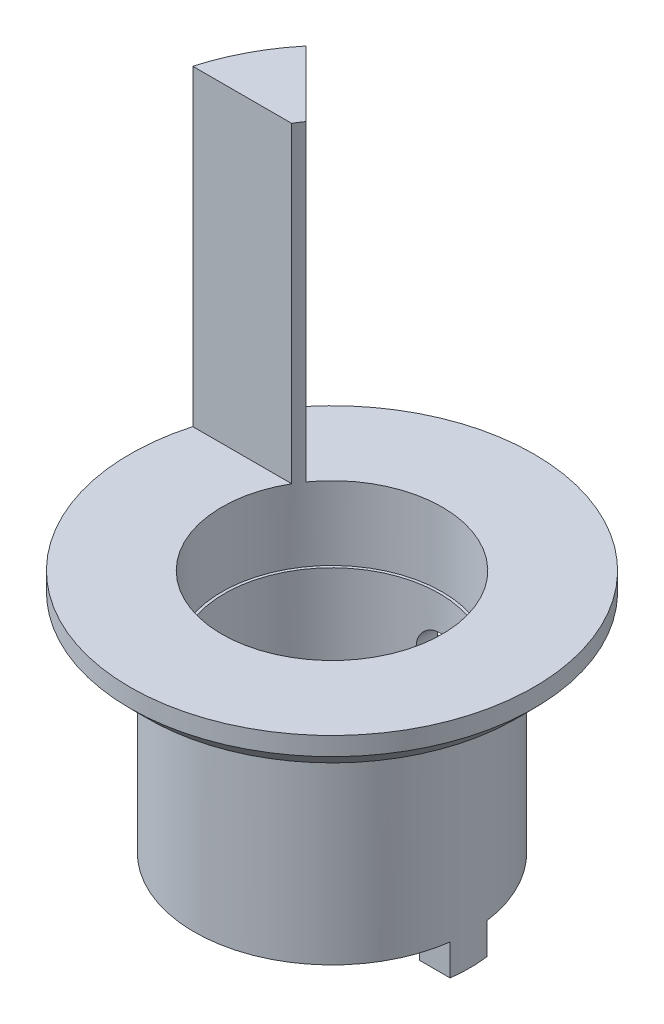
ISO-10303-21;
HEADER;
FILE_DESCRIPTION(('STEP AP214'),'2;1');
FILE_NAME('part.step','',(''),(''),'','','');
FILE_SCHEMA(('AUTOMOTIVE_DESIGN { 1 0 10303 214 1 1 1 1 }'));
ENDSEC;
DATA;
#1=APPLICATION_CONTEXT('core data for automotive mechanical design processes');
#2=APPLICATION_PROTOCOL_DEFINITION('international standard','automotive_design',2000,#1);
#3=PRODUCT_CONTEXT('',#1,'mechanical');
#4=PRODUCT('Part','Part','',(#3));
#5=PRODUCT_RELATED_PRODUCT_CATEGORY('part','',(#4));
#6=PRODUCT_DEFINITION_FORMATION('','',#4);
#7=PRODUCT_DEFINITION_CONTEXT('part definition',#1,'design');
#8=PRODUCT_DEFINITION('design','',#6,#7);
#9=PRODUCT_DEFINITION_SHAPE('','',#8);
#10=(LENGTH_UNIT() NAMED_UNIT(*) SI_UNIT(.MILLI.,.METRE.));
#11=(NAMED_UNIT(*) PLANE_ANGLE_UNIT() SI_UNIT($,.RADIAN.));
#12=(NAMED_UNIT(*) SI_UNIT($,.STERADIAN.) SOLID_ANGLE_UNIT());
#13=UNCERTAINTY_MEASURE_WITH_UNIT(LENGTH_MEASURE(1.E-05),#10,'distance_accuracy_value','');
#14=(GEOMETRIC_REPRESENTATION_CONTEXT(3) GLOBAL_UNCERTAINTY_ASSIGNED_CONTEXT((#13)) GLOBAL_UNIT_ASSIGNED_CONTEXT((#10,
#11,#12)) REPRESENTATION_CONTEXT('',''));
#15=CARTESIAN_POINT('',(0.,0.,0.));
#16=DIRECTION('',(0.,0.,1.));
#17=DIRECTION('',(1.,0.,0.));
#18=AXIS2_PLACEMENT_3D('',#15,#16,#17);
#19=CARTESIAN_POINT('',(0.,0.,0.));
#20=DIRECTION('',(0.,-1.,0.));
#21=DIRECTION('',(0.,0.,-1.));
#22=AXIS2_PLACEMENT_3D('',#19,#20,#21);
#23=CYLINDRICAL_SURFACE('',#22,7.5);
#24=CARTESIAN_POINT('',(0.,1.7,0.));
#25=DIRECTION('',(0.,-1.,0.));
#26=DIRECTION('',(0.,0.,-1.));
#27=AXIS2_PLACEMENT_3D('',#24,#25,#26);
#28=CIRCLE('',#27,7.5);
#29=CARTESIAN_POINT('',(7.43303437365925,1.7,-1.));
#30=VERTEX_POINT('',#29);
#31=CARTESIAN_POINT('',(7.43303437365925,1.7,1.));
#32=VERTEX_POINT('',#31);
#33=EDGE_CURVE('E115',#30,#32,#28,.F.);
#34=ORIENTED_EDGE('',*,*,#33,.T.);
#35=DIRECTION('',(0.,-1.,0.));
#36=VECTOR('',#35,1.);
#37=CARTESIAN_POINT('',(7.43303437365925,1.7,1.));
#38=LINE('',#37,#36);
#39=CARTESIAN_POINT('',(7.43303437365925,0.,1.));
#40=VERTEX_POINT('',#39);
#41=EDGE_CURVE('E192',#32,#40,#38,.T.);
#42=ORIENTED_EDGE('',*,*,#41,.T.);
#43=CARTESIAN_POINT('',(0.,0.,0.));
#44=DIRECTION('',(0.,-1.,0.));
#45=DIRECTION('',(0.,0.,-1.));
#46=AXIS2_PLACEMENT_3D('',#43,#44,#45);
#47=CIRCLE('',#46,7.5);
#48=CARTESIAN_POINT('',(7.43303437365926,0.,-1.));
#49=VERTEX_POINT('',#48);
#50=EDGE_CURVE('E153',#49,#40,#47,.T.);
#51=ORIENTED_EDGE('',*,*,#50,.F.);
#52=DIRECTION('',(0.,-1.,0.));
#53=VECTOR('',#52,1.);
#54=CARTESIAN_POINT('',(7.43303437365926,1.7,-1.));
#55=LINE('',#54,#53);
#56=EDGE_CURVE('E193',#30,#49,#55,.T.);
#57=ORIENTED_EDGE('',*,*,#56,.F.);
#58=EDGE_LOOP('',(#34,#42,#51,#57));
#59=FACE_BOUND('',#58,.T.);
#60=CARTESIAN_POINT('',(0.,13.,0.));
#61=DIRECTION('',(0.,-1.,0.));
#62=DIRECTION('',(0.,0.,-1.));
#63=AXIS2_PLACEMENT_3D('',#60,#61,#62);
#64=CIRCLE('',#63,7.5);
#65=CARTESIAN_POINT('',(0.,13.,-7.5));
#66=VERTEX_POINT('',#65);
#67=EDGE_CURVE('E150',#66,#66,#64,.T.);
#68=ORIENTED_EDGE('',*,*,#67,.T.);
#69=EDGE_LOOP('',(#68));
#70=FACE_BOUND('',#69,.T.);
#71=CARTESIAN_POINT('',(0.,10.5,0.));
#72=DIRECTION('',(0.,-1.,0.));
#73=DIRECTION('',(0.,0.,-1.));
#74=AXIS2_PLACEMENT_3D('',#71,#72,#73);
#75=CIRCLE('',#74,7.5);
#76=CARTESIAN_POINT('',(2.69258240356725,10.5,-7.));
#77=VERTEX_POINT('',#76);
#78=CARTESIAN_POINT('',(-2.69258240356725,10.5,-7.));
#79=VERTEX_POINT('',#78);
#80=EDGE_CURVE('E12',#77,#79,#75,.F.);
#81=ORIENTED_EDGE('',*,*,#80,.T.);
#82=DIRECTION('',(0.,-1.,0.));
#83=VECTOR('',#82,1.);
#84=CARTESIAN_POINT('',(-2.69258240356725,0.,-7.));
#85=LINE('',#84,#83);
#86=CARTESIAN_POINT('',(-2.69258240356725,5.5,-7.));
#87=VERTEX_POINT('',#86);
#88=EDGE_CURVE('E114',#79,#87,#85,.T.);
#89=ORIENTED_EDGE('',*,*,#88,.T.);
#90=CARTESIAN_POINT('',(0.,5.5,0.));
#91=DIRECTION('',(0.,1.,0.));
#92=DIRECTION('',(0.,0.,1.));
#93=AXIS2_PLACEMENT_3D('',#90,#91,#92);
#94=CIRCLE('',#93,7.5);
#95=CARTESIAN_POINT('',(2.69258240356725,5.5,-7.));
#96=VERTEX_POINT('',#95);
#97=EDGE_CURVE('E109',#87,#96,#94,.F.);
#98=ORIENTED_EDGE('',*,*,#97,.T.);
#99=DIRECTION('',(0.,-1.,0.));
#100=VECTOR('',#99,1.);
#101=CARTESIAN_POINT('',(2.69258240356725,0.,-7.));
#102=LINE('',#101,#100);
#103=EDGE_CURVE('E43',#96,#77,#102,.F.);
#104=ORIENTED_EDGE('',*,*,#103,.T.);
#105=EDGE_LOOP('',(#81,#89,#98,#104));
#106=FACE_BOUND('',#105,.T.);
#107=ADVANCED_FACE('F35',(#59,#70,#106),#23,.T.);
#108=CARTESIAN_POINT('',(7.5,0.,0.));
#109=DIRECTION('',(0.,-1.,0.));
#110=DIRECTION('',(0.,0.,-1.));
#111=AXIS2_PLACEMENT_3D('',#108,#109,#110);
#112=PLANE('',#111);
#113=ORIENTED_EDGE('',*,*,#50,.T.);
#114=DIRECTION('',(-1.,0.,0.));
#115=VECTOR('',#114,1.);
#116=CARTESIAN_POINT('',(3.95432279428579,0.,1.));
#117=LINE('',#116,#115);
#118=CARTESIAN_POINT('',(5.76389625166866,0.,1.));
#119=VERTEX_POINT('',#118);
#120=EDGE_CURVE('E198',#40,#119,#117,.T.);
#121=ORIENTED_EDGE('',*,*,#120,.T.);
#122=CARTESIAN_POINT('',(0.,0.,0.));
#123=DIRECTION('',(0.,-1.,0.));
#124=DIRECTION('',(0.,0.,-1.));
#125=AXIS2_PLACEMENT_3D('',#122,#123,#124);
#126=CIRCLE('',#125,5.85);
#127=CARTESIAN_POINT('',(5.76389625166866,0.,-1.));
#128=VERTEX_POINT('',#127);
#129=EDGE_CURVE('E135',#128,#119,#126,.T.);
#130=ORIENTED_EDGE('',*,*,#129,.F.);
#131=DIRECTION('',(1.,0.,0.));
#132=VECTOR('',#131,1.);
#133=CARTESIAN_POINT('',(3.95533055499043,0.,-1.));
#134=LINE('',#133,#132);
#135=EDGE_CURVE('E201',#128,#49,#134,.T.);
#136=ORIENTED_EDGE('',*,*,#135,.T.);
#137=EDGE_LOOP('',(#113,#121,#130,#136));
#138=FACE_BOUND('',#137,.T.);
#139=ADVANCED_FACE('F232',(#138),#112,.T.);
#140=CARTESIAN_POINT('',(0.,0.,0.));
#141=DIRECTION('',(0.,-1.,0.));
#142=DIRECTION('',(0.,0.,-1.));
#143=AXIS2_PLACEMENT_3D('',#140,#141,#142);
#144=CYLINDRICAL_SURFACE('',#143,5.85);
#145=CARTESIAN_POINT('',(0.,9.15,-5.85));
#146=CARTESIAN_POINT('',(-0.0639362439250115,9.14999762150668,-5.84999882589901));
#147=CARTESIAN_POINT('',(-0.127902797909633,9.14465001426181,-5.84894105918849));
#148=CARTESIAN_POINT('',(-0.254029380897406,9.12341696431288,-5.84482342562457));
#149=CARTESIAN_POINT('',(-0.316187907266502,9.10752300391135,-5.84176194050755));
#150=CARTESIAN_POINT('',(-0.436856483250227,9.06570596491934,-5.83397889878917));
#151=CARTESIAN_POINT('',(-0.495369911712778,9.03979233971554,-5.82925890734271));
#152=CARTESIAN_POINT('',(-0.607214082651757,8.97869930882743,-5.81867260580235));
#153=CARTESIAN_POINT('',(-0.660545164281559,8.94352051005272,-5.81280637079895));
#154=CARTESIAN_POINT('',(-0.761214129278735,8.86440677373918,-5.80048777640998));
#155=CARTESIAN_POINT('',(-0.80847429868122,8.82037388410442,-5.79402934424765));
#156=CARTESIAN_POINT('',(-0.894987151339035,8.72501250394132,-5.78129868960505));
#157=CARTESIAN_POINT('',(-0.934239223582949,8.67368345722863,-5.77502648136467));
#158=CARTESIAN_POINT('',(-1.00395033505011,8.56463053388572,-5.76331921500734));
#159=CARTESIAN_POINT('',(-1.03432930014803,8.50685455709959,-5.75789197514049));
#160=CARTESIAN_POINT('',(-1.08491897341453,8.38689415210329,-5.74857519599905));
#161=CARTESIAN_POINT('',(-1.1051306501539,8.32471014446143,-5.74468551025933));
#162=CARTESIAN_POINT('',(-1.13456052302771,8.19853371223078,-5.73894559787116));
#163=CARTESIAN_POINT('',(-1.14391484196513,8.13457420843679,-5.73707014087594));
#164=CARTESIAN_POINT('',(-1.15178719279853,8.00596819705888,-5.7354950553456));
#165=CARTESIAN_POINT('',(-1.15030629443291,7.9413217579239,-5.73579521201667));
#166=CARTESIAN_POINT('',(-1.13666039437753,7.81417012938082,-5.73851450307477));
#167=CARTESIAN_POINT('',(-1.12465108537978,7.75164747241157,-5.74090275757322));
#168=CARTESIAN_POINT('',(-1.09053486189186,7.62952200227101,-5.74748055889506));
#169=CARTESIAN_POINT('',(-1.068427479961,7.56991932440723,-5.75167018910375));
#170=CARTESIAN_POINT('',(-1.0145929907201,7.45487510980827,-5.76141044554859));
#171=CARTESIAN_POINT('',(-0.982803850151624,7.39946337109607,-5.76696980271608));
#172=CARTESIAN_POINT('',(-0.910552018302302,7.29470220004211,-5.77881746176649));
#173=CARTESIAN_POINT('',(-0.870088362685915,7.24535344267508,-5.78510584465862));
#174=CARTESIAN_POINT('',(-0.780800886431417,7.15322035291147,-5.79783700799188));
#175=CARTESIAN_POINT('',(-0.731844102983219,7.11056488073724,-5.80428057341843));
#176=CARTESIAN_POINT('',(-0.627402781243577,7.0340516258251,-5.81649598879284));
#177=CARTESIAN_POINT('',(-0.571918164593694,7.00019394870931,-5.82226783067586));
#178=CARTESIAN_POINT('',(-0.455855482992069,6.94221490229615,-5.8325029231493));
#179=CARTESIAN_POINT('',(-0.395270063938784,6.91810789186111,-5.83696424123284));
#180=CARTESIAN_POINT('',(-0.270802116146046,6.88044988741464,-5.84406087870471));
#181=CARTESIAN_POINT('',(-0.20691997395967,6.8668976588007,-5.84669641165281));
#182=CARTESIAN_POINT('',(-0.0787796623853063,6.85091549162956,-5.84981489789834));
#183=CARTESIAN_POINT('',(-0.0145442998063021,6.84830914740789,-5.85033198898164));
#184=CARTESIAN_POINT('',(0.113444149876428,6.85381817994475,-5.84925000439324));
#185=CARTESIAN_POINT('',(0.177197262942997,6.86193297531818,-5.84765104347062));
#186=CARTESIAN_POINT('',(0.301845072991864,6.88850734913124,-5.84253794904101));
#187=CARTESIAN_POINT('',(0.362759737563793,6.90687676360053,-5.83904051520608));
#188=CARTESIAN_POINT('',(0.480644431914309,6.95334067571176,-5.83052114785961));
#189=CARTESIAN_POINT('',(0.537614173340961,6.98143588335652,-5.82549910305164));
#190=CARTESIAN_POINT('',(0.646738316401307,7.04693794838087,-5.81440251529445));
#191=CARTESIAN_POINT('',(0.698827477194771,7.08445145485034,-5.80831617832597));
#192=CARTESIAN_POINT('',(0.796034738802524,7.16758202506149,-5.79579460007079));
#193=CARTESIAN_POINT('',(0.841152118424703,7.21319992611,-5.78935932278105));
#194=CARTESIAN_POINT('',(0.923813002746023,7.3120462018211,-5.77675059451517));
#195=CARTESIAN_POINT('',(0.961235600385171,7.36537646723839,-5.77058237395043));
#196=CARTESIAN_POINT('',(1.02659185718823,7.47766977441016,-5.75931537070963));
#197=CARTESIAN_POINT('',(1.05452588903283,7.53663259481922,-5.75421654603412));
#198=CARTESIAN_POINT('',(1.0999452148694,7.65822494564769,-5.74570755105009));
#199=CARTESIAN_POINT('',(1.11748368755018,7.72083398299363,-5.74228880192331));
#200=CARTESIAN_POINT('',(1.14177612121422,7.84818444339559,-5.73750845799056));
#201=CARTESIAN_POINT('',(1.14853143496494,7.9129255979333,-5.73614660514427));
#202=CARTESIAN_POINT('',(1.15101705900788,8.04148941278183,-5.73564823039899));
#203=CARTESIAN_POINT('',(1.14693832589469,8.10530830878675,-5.73647316454363));
#204=CARTESIAN_POINT('',(1.12829213904687,8.23133145625185,-5.74016947785744));
#205=CARTESIAN_POINT('',(1.11372476330651,8.29353571971499,-5.74304084180923));
#206=CARTESIAN_POINT('',(1.07459871429202,8.41444759567504,-5.75048952858364));
#207=CARTESIAN_POINT('',(1.05006269375191,8.4731627922483,-5.75506298161574));
#208=CARTESIAN_POINT('',(0.99171746178846,8.58567326521398,-5.76540288572893));
#209=CARTESIAN_POINT('',(0.95790750660222,8.63946814653902,-5.77116943248616));
#210=CARTESIAN_POINT('',(0.881318671932414,8.74156340389809,-5.78336419403516));
#211=CARTESIAN_POINT('',(0.838401586449317,8.78975900814033,-5.78980172178431));
#212=CARTESIAN_POINT('',(0.745102903055356,8.87832777972418,-5.80254547495117));
#213=CARTESIAN_POINT('',(0.694719592633556,8.91869914752282,-5.80885166986587));
#214=CARTESIAN_POINT('',(0.587310682140758,8.99085546166041,-5.82069684278169));
#215=CARTESIAN_POINT('',(0.530223419545151,9.0225500429412,-5.82622747389035));
#216=CARTESIAN_POINT('',(0.411441296368771,9.07584638624003,-5.83581641170007));
#217=CARTESIAN_POINT('',(0.349750697785931,9.09745735292728,-5.83987606040481));
#218=CARTESIAN_POINT('',(0.239924414949608,9.12573075122605,-5.84526600714723));
#219=CARTESIAN_POINT('',(0.192418801781337,9.13481568303911,-5.84703096762314));
#220=CARTESIAN_POINT('',(0.0966145462147334,9.14695111568422,-5.84939839025398));
#221=CARTESIAN_POINT('',(0.04831592763165,9.15000179740166,-5.85000088725541));
#222=CARTESIAN_POINT('',(0.,9.15,-5.85));
#223=B_SPLINE_CURVE_WITH_KNOTS('',3,(#145,#146,#147,#148,#149,#150,#151,#152,#153,#154,#155,
#156,#157,#158,#159,#160,#161,#162,#163,#164,#165,#166,#167,#168,#169,#170,#171,#172,#173,#174,
#175,#176,#177,#178,#179,#180,#181,#182,#183,#184,#185,#186,#187,#188,#189,#190,#191,#192,#193,
#194,#195,#196,#197,#198,#199,#200,#201,#202,#203,#204,#205,#206,#207,#208,#209,#210,#211,#212,
#213,#214,#215,#216,#217,#218,#219,#220,#221,#222),.UNSPECIFIED.,.T.,.F.,(4,2,2,2,2,2,2,2,2,2,2,
2,2,2,2,2,2,2,2,2,2,2,2,2,2,2,2,2,2,2,2,2,2,2,2,2,2,2,4),(0.,0.191631994478293,0.38341894805032,
0.575025393631865,0.766619291269066,0.960462589117445,1.15432067152789,1.34987766734064,
1.54541603019331,1.73847543020507,1.93151577012232,2.12174871413538,2.31199046494052,
2.50347773888106,2.69498631128378,2.88982015704902,3.08465634178858,3.27977840735138,
3.4748776458782,3.6668202721906,3.85875249028092,4.04902313228776,4.23930766737129,
4.43185260423332,4.62441744548716,4.81980913152414,5.01519314230947,5.20956883772379,
5.40392014642649,5.59486872465961,5.78581588300104,5.97633153878923,6.16686247826591,
6.36052319607699,6.55422840235469,6.74988022050116,6.94535308985977,7.09017165550426,
7.23498587993667),.UNSPECIFIED.);
#224=CARTESIAN_POINT('',(0.,9.15,-5.85));
#225=VERTEX_POINT('',#224);
#226=EDGE_CURVE('E123',#225,#225,#223,.T.);
#227=ORIENTED_EDGE('',*,*,#226,.F.);
#228=EDGE_LOOP('',(#227));
#229=FACE_BOUND('',#228,.T.);
#230=CARTESIAN_POINT('',(0.,11.,0.));
#231=DIRECTION('',(0.,-1.,0.));
#232=DIRECTION('',(0.,0.,-1.));
#233=AXIS2_PLACEMENT_3D('',#230,#231,#232);
#234=CIRCLE('',#233,5.85);
#235=CARTESIAN_POINT('',(0.,11.,-5.85));
#236=VERTEX_POINT('',#235);
#237=EDGE_CURVE('E138',#236,#236,#234,.T.);
#238=ORIENTED_EDGE('',*,*,#237,.F.);
#239=EDGE_LOOP('',(#238));
#240=FACE_BOUND('',#239,.T.);
#241=ORIENTED_EDGE('',*,*,#129,.T.);
#242=DIRECTION('',(0.,-1.,0.));
#243=VECTOR('',#242,1.);
#244=CARTESIAN_POINT('',(5.76389625166866,0.,1.));
#245=LINE('',#244,#243);
#246=CARTESIAN_POINT('',(5.76389625166866,1.7,1.));
#247=VERTEX_POINT('',#246);
#248=EDGE_CURVE('E186',#119,#247,#245,.F.);
#249=ORIENTED_EDGE('',*,*,#248,.T.);
#250=CARTESIAN_POINT('',(0.,1.7,0.));
#251=DIRECTION('',(0.,-1.,0.));
#252=DIRECTION('',(0.,0.,-1.));
#253=AXIS2_PLACEMENT_3D('',#250,#251,#252);
#254=CIRCLE('',#253,5.85);
#255=CARTESIAN_POINT('',(5.76389625166866,1.7,-1.));
#256=VERTEX_POINT('',#255);
#257=EDGE_CURVE('E176',#247,#256,#254,.T.);
#258=ORIENTED_EDGE('',*,*,#257,.T.);
#259=DIRECTION('',(0.,-1.,0.));
#260=VECTOR('',#259,1.);
#261=CARTESIAN_POINT('',(5.76389625166866,0.,-1.));
#262=LINE('',#261,#260);
#263=EDGE_CURVE('E189',#256,#128,#262,.T.);
#264=ORIENTED_EDGE('',*,*,#263,.T.);
#265=EDGE_LOOP('',(#241,#249,#258,#264));
#266=FACE_BOUND('',#265,.T.);
#267=ADVANCED_FACE('F240',(#229,#240,#266),#144,.F.);
#268=CARTESIAN_POINT('',(6.,32.,0.));
#269=DIRECTION('',(0.,1.,0.));
#270=DIRECTION('',(0.,0.,1.));
#271=AXIS2_PLACEMENT_3D('',#268,#269,#270);
#272=PLANE('',#271);
#273=CARTESIAN_POINT('',(0.,32.,0.));
#274=DIRECTION('',(0.,-1.,0.));
#275=DIRECTION('',(0.,0.,-1.));
#276=AXIS2_PLACEMENT_3D('',#273,#274,#275);
#277=CIRCLE('',#276,11.);
#278=CARTESIAN_POINT('',(-10.5830052442584,32.,-3.));
#279=VERTEX_POINT('',#278);
#280=CARTESIAN_POINT('',(-8.45307347360137,32.,-7.0388599112283));
#281=VERTEX_POINT('',#280);
#282=EDGE_CURVE('E147',#279,#281,#277,.T.);
#283=ORIENTED_EDGE('',*,*,#282,.F.);
#284=DIRECTION('',(1.,0.,0.));
#285=VECTOR('',#284,1.);
#286=CARTESIAN_POINT('',(-24.3414213562373,32.,-3.));
#287=LINE('',#286,#285);
#288=CARTESIAN_POINT('',(-5.19615242270663,32.,-3.));
#289=VERTEX_POINT('',#288);
#290=EDGE_CURVE('E170',#279,#289,#287,.T.);
#291=ORIENTED_EDGE('',*,*,#290,.T.);
#292=CARTESIAN_POINT('',(0.,32.,0.));
#293=DIRECTION('',(0.,-1.,0.));
#294=DIRECTION('',(0.,0.,-1.));
#295=AXIS2_PLACEMENT_3D('',#292,#293,#294);
#296=CIRCLE('',#295,6.);
#297=CARTESIAN_POINT('',(-4.89040691385686,32.,-3.47619335148392));
#298=VERTEX_POINT('',#297);
#299=EDGE_CURVE('E144',#289,#298,#296,.T.);
#300=ORIENTED_EDGE('',*,*,#299,.T.);
#301=DIRECTION('',(0.707106781186546,0.,0.707106781186549));
#302=VECTOR('',#301,1.);
#303=CARTESIAN_POINT('',(-12.8778174593052,32.,-11.4636038969321));
#304=LINE('',#303,#302);
#305=EDGE_CURVE('E174',#281,#298,#304,.T.);
#306=ORIENTED_EDGE('',*,*,#305,.F.);
#307=EDGE_LOOP('',(#283,#291,#300,#306));
#308=FACE_BOUND('',#307,.T.);
#309=ADVANCED_FACE('F257',(#308),#272,.T.);
#310=CARTESIAN_POINT('',(0.,0.,0.));
#311=DIRECTION('',(0.,-1.,0.));
#312=DIRECTION('',(0.,0.,-1.));
#313=AXIS2_PLACEMENT_3D('',#310,#311,#312);
#314=CYLINDRICAL_SURFACE('',#313,11.);
#315=CARTESIAN_POINT('',(0.,14.,0.));
#316=DIRECTION('',(0.,-1.,0.));
#317=DIRECTION('',(0.,0.,-1.));
#318=AXIS2_PLACEMENT_3D('',#315,#316,#317);
#319=CIRCLE('',#318,11.);
#320=CARTESIAN_POINT('',(0.,14.,-11.));
#321=VERTEX_POINT('',#320);
#322=EDGE_CURVE('E129',#321,#321,#319,.F.);
#323=ORIENTED_EDGE('',*,*,#322,.T.);
#324=EDGE_LOOP('',(#323));
#325=FACE_BOUND('',#324,.T.);
#326=CARTESIAN_POINT('',(0.,15.,0.));
#327=DIRECTION('',(0.,1.,0.));
#328=DIRECTION('',(0.,0.,1.));
#329=AXIS2_PLACEMENT_3D('',#326,#327,#328);
#330=CIRCLE('',#329,11.);
#331=CARTESIAN_POINT('',(-10.5830052442584,15.,-3.));
#332=VERTEX_POINT('',#331);
#333=CARTESIAN_POINT('',(-8.45307347360137,15.,-7.0388599112283));
#334=VERTEX_POINT('',#333);
#335=EDGE_CURVE('E173',#332,#334,#330,.T.);
#336=ORIENTED_EDGE('',*,*,#335,.F.);
#337=DIRECTION('',(0.,1.,0.));
#338=VECTOR('',#337,1.);
#339=CARTESIAN_POINT('',(-10.5830052442584,15.,-3.));
#340=LINE('',#339,#338);
#341=EDGE_CURVE('E159',#332,#279,#340,.T.);
#342=ORIENTED_EDGE('',*,*,#341,.T.);
#343=ORIENTED_EDGE('',*,*,#282,.T.);
#344=DIRECTION('',(0.,1.,0.));
#345=VECTOR('',#344,1.);
#346=CARTESIAN_POINT('',(-8.45307347360137,15.,-7.0388599112283));
#347=LINE('',#346,#345);
#348=EDGE_CURVE('E160',#334,#281,#347,.T.);
#349=ORIENTED_EDGE('',*,*,#348,.F.);
#350=EDGE_LOOP('',(#336,#342,#343,#349));
#351=FACE_BOUND('',#350,.T.);
#352=ADVANCED_FACE('F253',(#325,#351),#314,.T.);
#353=CARTESIAN_POINT('',(5.85,11.,0.));
#354=DIRECTION('',(0.,1.,0.));
#355=DIRECTION('',(0.,0.,1.));
#356=AXIS2_PLACEMENT_3D('',#353,#354,#355);
#357=PLANE('',#356);
#358=ORIENTED_EDGE('',*,*,#237,.T.);
#359=EDGE_LOOP('',(#358));
#360=FACE_BOUND('',#359,.T.);
#361=CARTESIAN_POINT('',(0.,11.,0.));
#362=DIRECTION('',(0.,-1.,0.));
#363=DIRECTION('',(0.,0.,-1.));
#364=AXIS2_PLACEMENT_3D('',#361,#362,#363);
#365=CIRCLE('',#364,6.);
#366=CARTESIAN_POINT('',(0.,11.,-6.));
#367=VERTEX_POINT('',#366);
#368=EDGE_CURVE('E141',#367,#367,#365,.T.);
#369=ORIENTED_EDGE('',*,*,#368,.F.);
#370=EDGE_LOOP('',(#369));
#371=FACE_BOUND('',#370,.T.);
#372=ADVANCED_FACE('F256',(#360,#371),#357,.T.);
#373=CARTESIAN_POINT('',(0.,0.,0.));
#374=DIRECTION('',(0.,-1.,0.));
#375=DIRECTION('',(0.,0.,-1.));
#376=AXIS2_PLACEMENT_3D('',#373,#374,#375);
#377=CYLINDRICAL_SURFACE('',#376,6.);
#378=DIRECTION('',(0.,1.,0.));
#379=VECTOR('',#378,1.);
#380=CARTESIAN_POINT('',(-5.19615242270663,15.,-3.));
#381=LINE('',#380,#379);
#382=CARTESIAN_POINT('',(-5.19615242270663,15.,-3.));
#383=VERTEX_POINT('',#382);
#384=EDGE_CURVE('E166',#383,#289,#381,.T.);
#385=ORIENTED_EDGE('',*,*,#384,.F.);
#386=CARTESIAN_POINT('',(0.,15.,0.));
#387=DIRECTION('',(0.,1.,0.));
#388=DIRECTION('',(0.,0.,1.));
#389=AXIS2_PLACEMENT_3D('',#386,#387,#388);
#390=CIRCLE('',#389,6.);
#391=CARTESIAN_POINT('',(-4.89040691385686,15.,-3.47619335148392));
#392=VERTEX_POINT('',#391);
#393=EDGE_CURVE('E156',#383,#392,#390,.T.);
#394=ORIENTED_EDGE('',*,*,#393,.T.);
#395=DIRECTION('',(0.,1.,0.));
#396=VECTOR('',#395,1.);
#397=CARTESIAN_POINT('',(-4.89040691385686,15.,-3.47619335148392));
#398=LINE('',#397,#396);
#399=EDGE_CURVE('E162',#392,#298,#398,.T.);
#400=ORIENTED_EDGE('',*,*,#399,.T.);
#401=ORIENTED_EDGE('',*,*,#299,.F.);
#402=EDGE_LOOP('',(#385,#394,#400,#401));
#403=FACE_BOUND('',#402,.T.);
#404=ORIENTED_EDGE('',*,*,#368,.T.);
#405=EDGE_LOOP('',(#404));
#406=FACE_BOUND('',#405,.T.);
#407=ADVANCED_FACE('F251',(#403,#406),#377,.F.);
#408=CARTESIAN_POINT('',(11.,13.,0.));
#409=DIRECTION('',(0.,-1.,0.));
#410=DIRECTION('',(0.,0.,-1.));
#411=AXIS2_PLACEMENT_3D('',#408,#409,#410);
#412=PLANE('',#411);
#413=CARTESIAN_POINT('',(0.,13.,0.));
#414=DIRECTION('',(0.,-1.,0.));
#415=DIRECTION('',(0.,0.,-1.));
#416=AXIS2_PLACEMENT_3D('',#413,#414,#415);
#417=CIRCLE('',#416,10.);
#418=CARTESIAN_POINT('',(0.,13.,-10.));
#419=VERTEX_POINT('',#418);
#420=EDGE_CURVE('E132',#419,#419,#417,.T.);
#421=ORIENTED_EDGE('',*,*,#420,.T.);
#422=EDGE_LOOP('',(#421));
#423=FACE_BOUND('',#422,.T.);
#424=ORIENTED_EDGE('',*,*,#67,.F.);
#425=EDGE_LOOP('',(#424));
#426=FACE_BOUND('',#425,.T.);
#427=ADVANCED_FACE('F247',(#423,#426),#412,.T.);
#428=CARTESIAN_POINT('',(-24.3414213562373,15.,-3.));
#429=DIRECTION('',(0.,0.,1.));
#430=DIRECTION('',(1.,0.,0.));
#431=AXIS2_PLACEMENT_3D('',#428,#429,#430);
#432=PLANE('',#431);
#433=ORIENTED_EDGE('',*,*,#290,.F.);
#434=ORIENTED_EDGE('',*,*,#341,.F.);
#435=DIRECTION('',(1.,0.,0.));
#436=VECTOR('',#435,1.);
#437=CARTESIAN_POINT('',(-24.3414213562373,15.,-3.));
#438=LINE('',#437,#436);
#439=EDGE_CURVE('E163',#332,#383,#438,.T.);
#440=ORIENTED_EDGE('',*,*,#439,.T.);
#441=ORIENTED_EDGE('',*,*,#384,.T.);
#442=EDGE_LOOP('',(#433,#434,#440,#441));
#443=FACE_BOUND('',#442,.T.);
#444=ADVANCED_FACE('F250',(#443),#432,.T.);
#445=CARTESIAN_POINT('',(-12.8778174593052,15.,-11.4636038969321));
#446=DIRECTION('',(-0.707106781186549,0.,0.707106781186546));
#447=DIRECTION('',(0.707106781186546,0.,0.707106781186549));
#448=AXIS2_PLACEMENT_3D('',#445,#446,#447);
#449=PLANE('',#448);
#450=ORIENTED_EDGE('',*,*,#305,.T.);
#451=ORIENTED_EDGE('',*,*,#399,.F.);
#452=DIRECTION('',(0.707106781186546,0.,0.707106781186549));
#453=VECTOR('',#452,1.);
#454=CARTESIAN_POINT('',(-12.8778174593052,15.,-11.4636038969321));
#455=LINE('',#454,#453);
#456=EDGE_CURVE('E179',#334,#392,#455,.T.);
#457=ORIENTED_EDGE('',*,*,#456,.F.);
#458=ORIENTED_EDGE('',*,*,#348,.T.);
#459=EDGE_LOOP('',(#450,#451,#457,#458));
#460=FACE_BOUND('',#459,.T.);
#461=ADVANCED_FACE('F245',(#460),#449,.F.);
#462=CARTESIAN_POINT('',(-24.3414213562373,15.,0.));
#463=DIRECTION('',(0.,1.,0.));
#464=DIRECTION('',(0.,0.,1.));
#465=AXIS2_PLACEMENT_3D('',#462,#463,#464);
#466=PLANE('',#465);
#467=ORIENTED_EDGE('',*,*,#439,.F.);
#468=ORIENTED_EDGE('',*,*,#335,.T.);
#469=ORIENTED_EDGE('',*,*,#456,.T.);
#470=ORIENTED_EDGE('',*,*,#393,.F.);
#471=EDGE_LOOP('',(#467,#468,#469,#470));
#472=FACE_BOUND('',#471,.T.);
#473=ADVANCED_FACE('F294',(#472),#466,.T.);
#474=CARTESIAN_POINT('',(0.,13.,0.));
#475=DIRECTION('',(0.,1.,0.));
#476=DIRECTION('',(0.,0.,1.));
#477=AXIS2_PLACEMENT_3D('',#474,#475,#476);
#478=CONICAL_SURFACE('',#477,10.,0.785398163397444);
#479=ORIENTED_EDGE('',*,*,#322,.F.);
#480=EDGE_LOOP('',(#479));
#481=FACE_BOUND('',#480,.T.);
#482=ORIENTED_EDGE('',*,*,#420,.F.);
#483=EDGE_LOOP('',(#482));
#484=FACE_BOUND('',#483,.T.);
#485=ADVANCED_FACE('F37',(#481,#484),#478,.T.);
#486=CARTESIAN_POINT('',(0.,1.7,0.));
#487=DIRECTION('',(0.,-1.,0.));
#488=DIRECTION('',(0.,0.,-1.));
#489=AXIS2_PLACEMENT_3D('',#486,#487,#488);
#490=PLANE('',#489);
#491=DIRECTION('',(-1.,0.,0.));
#492=VECTOR('',#491,1.);
#493=CARTESIAN_POINT('',(3.95432279428579,1.7,1.));
#494=LINE('',#493,#492);
#495=EDGE_CURVE('E195',#32,#247,#494,.T.);
#496=ORIENTED_EDGE('',*,*,#495,.F.);
#497=ORIENTED_EDGE('',*,*,#33,.F.);
#498=DIRECTION('',(1.,0.,0.));
#499=VECTOR('',#498,1.);
#500=CARTESIAN_POINT('',(3.95533055499043,1.7,-1.));
#501=LINE('',#500,#499);
#502=EDGE_CURVE('E57',#256,#30,#501,.T.);
#503=ORIENTED_EDGE('',*,*,#502,.F.);
#504=ORIENTED_EDGE('',*,*,#257,.F.);
#505=EDGE_LOOP('',(#496,#497,#503,#504));
#506=FACE_BOUND('',#505,.T.);
#507=ADVANCED_FACE('F285',(#506),#490,.T.);
#508=CARTESIAN_POINT('',(3.95432279428579,1.7,1.));
#509=DIRECTION('',(0.,0.,1.));
#510=DIRECTION('',(1.,0.,0.));
#511=AXIS2_PLACEMENT_3D('',#508,#509,#510);
#512=PLANE('',#511);
#513=ORIENTED_EDGE('',*,*,#120,.F.);
#514=ORIENTED_EDGE('',*,*,#41,.F.);
#515=ORIENTED_EDGE('',*,*,#495,.T.);
#516=ORIENTED_EDGE('',*,*,#248,.F.);
#517=EDGE_LOOP('',(#513,#514,#515,#516));
#518=FACE_BOUND('',#517,.T.);
#519=ADVANCED_FACE('F281',(#518),#512,.T.);
#520=CARTESIAN_POINT('',(3.95533055499043,1.7,-1.));
#521=DIRECTION('',(0.,0.,-1.));
#522=DIRECTION('',(-1.,0.,0.));
#523=AXIS2_PLACEMENT_3D('',#520,#521,#522);
#524=PLANE('',#523);
#525=ORIENTED_EDGE('',*,*,#502,.T.);
#526=ORIENTED_EDGE('',*,*,#56,.T.);
#527=ORIENTED_EDGE('',*,*,#135,.F.);
#528=ORIENTED_EDGE('',*,*,#263,.F.);
#529=EDGE_LOOP('',(#525,#526,#527,#528));
#530=FACE_BOUND('',#529,.T.);
#531=ADVANCED_FACE('F291',(#530),#524,.T.);
#532=CARTESIAN_POINT('',(65.0810769781276,10.5,-7.5));
#533=DIRECTION('',(0.,-1.,0.));
#534=DIRECTION('',(0.,0.,-1.));
#535=AXIS2_PLACEMENT_3D('',#532,#533,#534);
#536=PLANE('',#535);
#537=DIRECTION('',(-1.,0.,0.));
#538=VECTOR('',#537,1.);
#539=CARTESIAN_POINT('',(65.0810769781276,10.5,-7.));
#540=LINE('',#539,#538);
#541=EDGE_CURVE('E122',#77,#79,#540,.T.);
#542=ORIENTED_EDGE('',*,*,#541,.T.);
#543=ORIENTED_EDGE('',*,*,#80,.F.);
#544=EDGE_LOOP('',(#542,#543));
#545=FACE_BOUND('',#544,.T.);
#546=ADVANCED_FACE('F224',(#545),#536,.T.);
#547=CARTESIAN_POINT('',(65.0810769781276,10.5,-7.));
#548=DIRECTION('',(0.,0.,-1.));
#549=DIRECTION('',(0.,1.,0.));
#550=AXIS2_PLACEMENT_3D('',#547,#548,#549);
#551=PLANE('',#550);
#552=CARTESIAN_POINT('',(0.,8.,-7.));
#553=DIRECTION('',(0.,0.,-1.));
#554=DIRECTION('',(0.,1.,0.));
#555=AXIS2_PLACEMENT_3D('',#552,#553,#554);
#556=CIRCLE('',#555,1.25);
#557=CARTESIAN_POINT('',(0.,9.25,-7.));
#558=VERTEX_POINT('',#557);
#559=EDGE_CURVE('E395',#558,#558,#556,.T.);
#560=ORIENTED_EDGE('',*,*,#559,.F.);
#561=EDGE_LOOP('',(#560));
#562=FACE_BOUND('',#561,.T.);
#563=ORIENTED_EDGE('',*,*,#103,.F.);
#564=DIRECTION('',(-1.,0.,0.));
#565=VECTOR('',#564,1.);
#566=CARTESIAN_POINT('',(65.0810769781276,5.5,-7.));
#567=LINE('',#566,#565);
#568=EDGE_CURVE('E49',#96,#87,#567,.T.);
#569=ORIENTED_EDGE('',*,*,#568,.T.);
#570=ORIENTED_EDGE('',*,*,#88,.F.);
#571=ORIENTED_EDGE('',*,*,#541,.F.);
#572=EDGE_LOOP('',(#563,#569,#570,#571));
#573=FACE_BOUND('',#572,.T.);
#574=ADVANCED_FACE('F119',(#562,#573),#551,.T.);
#575=CARTESIAN_POINT('',(65.0810769781276,5.5,-7.));
#576=DIRECTION('',(0.,1.,0.));
#577=DIRECTION('',(0.,0.,1.));
#578=AXIS2_PLACEMENT_3D('',#575,#576,#577);
#579=PLANE('',#578);
#580=ORIENTED_EDGE('',*,*,#97,.F.);
#581=ORIENTED_EDGE('',*,*,#568,.F.);
#582=EDGE_LOOP('',(#580,#581));
#583=FACE_BOUND('',#582,.T.);
#584=ADVANCED_FACE('F110',(#583),#579,.T.);
#585=CARTESIAN_POINT('',(0.,8.,-7.));
#586=DIRECTION('',(0.,0.,-1.));
#587=DIRECTION('',(0.,1.,0.));
#588=AXIS2_PLACEMENT_3D('',#585,#586,#587);
#589=CYLINDRICAL_SURFACE('',#588,1.15);
#590=CARTESIAN_POINT('',(0.,8.,-6.9));
#591=DIRECTION('',(0.,0.,-1.));
#592=DIRECTION('',(0.,1.,0.));
#593=AXIS2_PLACEMENT_3D('',#590,#591,#592);
#594=CIRCLE('',#593,1.15);
#595=CARTESIAN_POINT('',(0.,9.15,-6.9));
#596=VERTEX_POINT('',#595);
#597=EDGE_CURVE('E214',#596,#596,#594,.T.);
#598=ORIENTED_EDGE('',*,*,#597,.T.);
#599=EDGE_LOOP('',(#598));
#600=FACE_BOUND('',#599,.T.);
#601=ORIENTED_EDGE('',*,*,#226,.T.);
#602=EDGE_LOOP('',(#601));
#603=FACE_BOUND('',#602,.T.);
#604=ADVANCED_FACE('F218',(#600,#603),#589,.F.);
#605=CARTESIAN_POINT('',(0.,8.,-7.));
#606=DIRECTION('',(0.,0.,-1.));
#607=DIRECTION('',(0.,1.,0.));
#608=AXIS2_PLACEMENT_3D('',#605,#606,#607);
#609=CONICAL_SURFACE('',#608,1.25,0.785398163397437);
#610=ORIENTED_EDGE('',*,*,#597,.F.);
#611=EDGE_LOOP('',(#610));
#612=FACE_BOUND('',#611,.T.);
#613=ORIENTED_EDGE('',*,*,#559,.T.);
#614=EDGE_LOOP('',(#613));
#615=FACE_BOUND('',#614,.T.);
#616=ADVANCED_FACE('F222',(#612,#615),#609,.F.);
#617=CLOSED_SHELL('',(#107,#139,#267,#309,#352,#372,#407,#427,#444,#461,#473,#485,#507,#519,
#531,#546,#574,#584,#604,#616));
#618=MANIFOLD_SOLID_BREP('B2',#617);
#619=ADVANCED_BREP_SHAPE_REPRESENTATION('',(#18,#618),#14);
#620=SHAPE_DEFINITION_REPRESENTATION(#9,#619);
ENDSEC;
END-ISO-10303-21;
